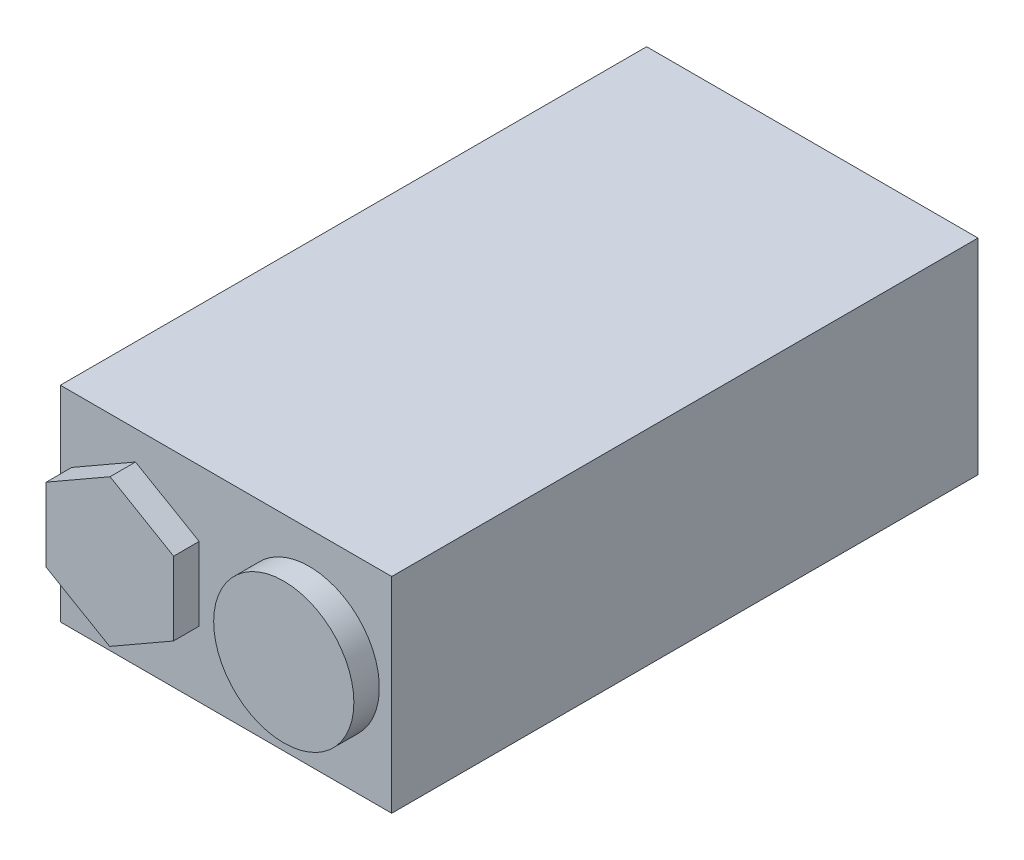
ISO-10303-21;
HEADER;
FILE_DESCRIPTION(('STEP AP214'),'2;1');
FILE_NAME('part.step','',(''),(''),'','','');
FILE_SCHEMA(('AUTOMOTIVE_DESIGN { 1 0 10303 214 1 1 1 1 }'));
ENDSEC;
DATA;
#1=APPLICATION_CONTEXT('core data for automotive mechanical design processes');
#2=APPLICATION_PROTOCOL_DEFINITION('international standard','automotive_design',2000,#1);
#3=PRODUCT_CONTEXT('',#1,'mechanical');
#4=PRODUCT('Part','Part','',(#3));
#5=PRODUCT_RELATED_PRODUCT_CATEGORY('part','',(#4));
#6=PRODUCT_DEFINITION_FORMATION('','',#4);
#7=PRODUCT_DEFINITION_CONTEXT('part definition',#1,'design');
#8=PRODUCT_DEFINITION('design','',#6,#7);
#9=PRODUCT_DEFINITION_SHAPE('','',#8);
#10=(LENGTH_UNIT() NAMED_UNIT(*) SI_UNIT(.MILLI.,.METRE.));
#11=(NAMED_UNIT(*) PLANE_ANGLE_UNIT() SI_UNIT($,.RADIAN.));
#12=(NAMED_UNIT(*) SI_UNIT($,.STERADIAN.) SOLID_ANGLE_UNIT());
#13=UNCERTAINTY_MEASURE_WITH_UNIT(LENGTH_MEASURE(1.E-05),#10,'distance_accuracy_value','');
#14=(GEOMETRIC_REPRESENTATION_CONTEXT(3) GLOBAL_UNCERTAINTY_ASSIGNED_CONTEXT((#13)) GLOBAL_UNIT_ASSIGNED_CONTEXT((#10,
#11,#12)) REPRESENTATION_CONTEXT('',''));
#15=CARTESIAN_POINT('',(0.,0.,0.));
#16=DIRECTION('',(0.,0.,1.));
#17=DIRECTION('',(1.,0.,0.));
#18=AXIS2_PLACEMENT_3D('',#15,#16,#17);
#19=CARTESIAN_POINT('',(0.,0.,46.));
#20=DIRECTION('',(0.,0.,-1.));
#21=DIRECTION('',(-1.,0.,0.));
#22=AXIS2_PLACEMENT_3D('',#19,#20,#21);
#23=PLANE('',#22);
#24=CARTESIAN_POINT('',(6.52944447302219,0.,46.));
#25=DIRECTION('',(0.,0.,-1.));
#26=DIRECTION('',(-1.,0.,0.));
#27=AXIS2_PLACEMENT_3D('',#24,#25,#26);
#28=CIRCLE('',#27,5.5);
#29=CARTESIAN_POINT('',(1.02944447302219,0.,46.));
#30=VERTEX_POINT('',#29);
#31=EDGE_CURVE('E11',#30,#30,#28,.F.);
#32=ORIENTED_EDGE('',*,*,#31,.F.);
#33=EDGE_LOOP('',(#32));
#34=FACE_BOUND('',#33,.T.);
#35=DIRECTION('',(0.,-1.,0.));
#36=VECTOR('',#35,1.);
#37=CARTESIAN_POINT('',(-13.,8.045,46.));
#38=LINE('',#37,#36);
#39=CARTESIAN_POINT('',(-13.,8.045,46.));
#40=VERTEX_POINT('',#39);
#41=CARTESIAN_POINT('',(-13.,-8.045,46.));
#42=VERTEX_POINT('',#41);
#43=EDGE_CURVE('E152',#40,#42,#38,.T.);
#44=ORIENTED_EDGE('',*,*,#43,.T.);
#45=DIRECTION('',(1.,0.,0.));
#46=VECTOR('',#45,1.);
#47=CARTESIAN_POINT('',(13.,-8.045,46.));
#48=LINE('',#47,#46);
#49=CARTESIAN_POINT('',(13.,-8.045,46.));
#50=VERTEX_POINT('',#49);
#51=EDGE_CURVE('E156',#42,#50,#48,.T.);
#52=ORIENTED_EDGE('',*,*,#51,.T.);
#53=DIRECTION('',(0.,1.,0.));
#54=VECTOR('',#53,1.);
#55=CARTESIAN_POINT('',(13.,8.045,46.));
#56=LINE('',#55,#54);
#57=CARTESIAN_POINT('',(13.,8.045,46.));
#58=VERTEX_POINT('',#57);
#59=EDGE_CURVE('E160',#50,#58,#56,.T.);
#60=ORIENTED_EDGE('',*,*,#59,.T.);
#61=DIRECTION('',(-1.,0.,0.));
#62=VECTOR('',#61,1.);
#63=CARTESIAN_POINT('',(13.,8.045,46.));
#64=LINE('',#63,#62);
#65=EDGE_CURVE('E163',#58,#40,#64,.T.);
#66=ORIENTED_EDGE('',*,*,#65,.T.);
#67=EDGE_LOOP('',(#44,#52,#60,#66));
#68=FACE_BOUND('',#67,.T.);
#69=DIRECTION('',(0.864665708593181,-0.502347700684548,0.));
#70=VECTOR('',#69,1.);
#71=CARTESIAN_POINT('',(-12.1269079719905,-2.87317564188084,46.));
#72=LINE('',#71,#70);
#73=CARTESIAN_POINT('',(-12.1269079719905,-2.87317564188084,46.));
#74=VERTEX_POINT('',#73);
#75=CARTESIAN_POINT('',(-7.13475817583735,-5.77348144405097,46.));
#76=VERTEX_POINT('',#75);
#77=EDGE_CURVE('E139',#74,#76,#72,.T.);
#78=ORIENTED_EDGE('',*,*,#77,.F.);
#79=DIRECTION('',(-0.00271301602892977,-0.999996319765241,0.));
#80=VECTOR('',#79,1.);
#81=CARTESIAN_POINT('',(-12.1112443666443,2.90030580217014,46.));
#82=LINE('',#81,#80);
#83=CARTESIAN_POINT('',(-12.1112443666443,2.90030580217014,46.));
#84=VERTEX_POINT('',#83);
#85=EDGE_CURVE('E136',#84,#74,#82,.T.);
#86=ORIENTED_EDGE('',*,*,#85,.F.);
#87=DIRECTION('',(-0.867378724622111,-0.497648619080693,0.));
#88=VECTOR('',#87,1.);
#89=CARTESIAN_POINT('',(-7.10343096514498,5.77348144405097,46.));
#90=LINE('',#89,#88);
#91=CARTESIAN_POINT('',(-7.10343096514498,5.77348144405097,46.));
#92=VERTEX_POINT('',#91);
#93=EDGE_CURVE('E221',#92,#84,#90,.T.);
#94=ORIENTED_EDGE('',*,*,#93,.F.);
#95=DIRECTION('',(-0.864665708593181,0.502347700684548,0.));
#96=VECTOR('',#95,1.);
#97=CARTESIAN_POINT('',(-2.11128116899187,2.87317564188084,46.));
#98=LINE('',#97,#96);
#99=CARTESIAN_POINT('',(-2.11128116899187,2.87317564188084,46.));
#100=VERTEX_POINT('',#99);
#101=EDGE_CURVE('E243',#100,#92,#98,.T.);
#102=ORIENTED_EDGE('',*,*,#101,.F.);
#103=DIRECTION('',(0.0027130160289297,0.999996319765241,0.));
#104=VECTOR('',#103,1.);
#105=CARTESIAN_POINT('',(-2.12694477433805,-2.90030580217014,46.));
#106=LINE('',#105,#104);
#107=CARTESIAN_POINT('',(-2.12694477433805,-2.90030580217014,46.));
#108=VERTEX_POINT('',#107);
#109=EDGE_CURVE('E60',#108,#100,#106,.T.);
#110=ORIENTED_EDGE('',*,*,#109,.F.);
#111=DIRECTION('',(0.867378724622111,0.497648619080693,0.));
#112=VECTOR('',#111,1.);
#113=CARTESIAN_POINT('',(-7.13475817583735,-5.77348144405097,46.));
#114=LINE('',#113,#112);
#115=EDGE_CURVE('E55',#76,#108,#114,.T.);
#116=ORIENTED_EDGE('',*,*,#115,.F.);
#117=EDGE_LOOP('',(#78,#86,#94,#102,#110,#116));
#118=FACE_BOUND('',#117,.T.);
#119=ADVANCED_FACE('F39',(#34,#68,#118),#23,.F.);
#120=CARTESIAN_POINT('',(-13.,8.045,46.));
#121=DIRECTION('',(1.,0.,0.));
#122=DIRECTION('',(0.,1.,0.));
#123=AXIS2_PLACEMENT_3D('',#120,#121,#122);
#124=PLANE('',#123);
#125=DIRECTION('',(0.,-1.,0.));
#126=VECTOR('',#125,1.);
#127=CARTESIAN_POINT('',(-13.,8.045,0.));
#128=LINE('',#127,#126);
#129=CARTESIAN_POINT('',(-13.,8.045,0.));
#130=VERTEX_POINT('',#129);
#131=CARTESIAN_POINT('',(-13.,-8.045,0.));
#132=VERTEX_POINT('',#131);
#133=EDGE_CURVE('E141',#130,#132,#128,.T.);
#134=ORIENTED_EDGE('',*,*,#133,.T.);
#135=DIRECTION('',(0.,0.,-1.));
#136=VECTOR('',#135,1.);
#137=CARTESIAN_POINT('',(-13.,-8.045,46.));
#138=LINE('',#137,#136);
#139=EDGE_CURVE('E48',#42,#132,#138,.T.);
#140=ORIENTED_EDGE('',*,*,#139,.F.);
#141=ORIENTED_EDGE('',*,*,#43,.F.);
#142=DIRECTION('',(0.,0.,-1.));
#143=VECTOR('',#142,1.);
#144=CARTESIAN_POINT('',(-13.,8.045,46.));
#145=LINE('',#144,#143);
#146=EDGE_CURVE('E165',#40,#130,#145,.T.);
#147=ORIENTED_EDGE('',*,*,#146,.T.);
#148=EDGE_LOOP('',(#134,#140,#141,#147));
#149=FACE_BOUND('',#148,.T.);
#150=ADVANCED_FACE('F41',(#149),#124,.F.);
#151=CARTESIAN_POINT('',(13.,-8.045,46.));
#152=DIRECTION('',(0.,1.,0.));
#153=DIRECTION('',(-1.,0.,0.));
#154=AXIS2_PLACEMENT_3D('',#151,#152,#153);
#155=PLANE('',#154);
#156=DIRECTION('',(1.,0.,0.));
#157=VECTOR('',#156,1.);
#158=CARTESIAN_POINT('',(13.,-8.045,0.));
#159=LINE('',#158,#157);
#160=CARTESIAN_POINT('',(13.,-8.045,0.));
#161=VERTEX_POINT('',#160);
#162=EDGE_CURVE('E146',#132,#161,#159,.T.);
#163=ORIENTED_EDGE('',*,*,#162,.T.);
#164=DIRECTION('',(0.,0.,-1.));
#165=VECTOR('',#164,1.);
#166=CARTESIAN_POINT('',(13.,-8.045,46.));
#167=LINE('',#166,#165);
#168=EDGE_CURVE('E181',#50,#161,#167,.T.);
#169=ORIENTED_EDGE('',*,*,#168,.F.);
#170=ORIENTED_EDGE('',*,*,#51,.F.);
#171=ORIENTED_EDGE('',*,*,#139,.T.);
#172=EDGE_LOOP('',(#163,#169,#170,#171));
#173=FACE_BOUND('',#172,.T.);
#174=ADVANCED_FACE('F188',(#173),#155,.F.);
#175=CARTESIAN_POINT('',(13.,8.045,46.));
#176=DIRECTION('',(-1.,0.,0.));
#177=DIRECTION('',(0.,-1.,0.));
#178=AXIS2_PLACEMENT_3D('',#175,#176,#177);
#179=PLANE('',#178);
#180=DIRECTION('',(0.,1.,0.));
#181=VECTOR('',#180,1.);
#182=CARTESIAN_POINT('',(13.,8.045,0.));
#183=LINE('',#182,#181);
#184=CARTESIAN_POINT('',(13.,8.045,0.));
#185=VERTEX_POINT('',#184);
#186=EDGE_CURVE('E169',#161,#185,#183,.T.);
#187=ORIENTED_EDGE('',*,*,#186,.T.);
#188=DIRECTION('',(0.,0.,-1.));
#189=VECTOR('',#188,1.);
#190=CARTESIAN_POINT('',(13.,8.045,46.));
#191=LINE('',#190,#189);
#192=EDGE_CURVE('E177',#58,#185,#191,.T.);
#193=ORIENTED_EDGE('',*,*,#192,.F.);
#194=ORIENTED_EDGE('',*,*,#59,.F.);
#195=ORIENTED_EDGE('',*,*,#168,.T.);
#196=EDGE_LOOP('',(#187,#193,#194,#195));
#197=FACE_BOUND('',#196,.T.);
#198=ADVANCED_FACE('F200',(#197),#179,.F.);
#199=CARTESIAN_POINT('',(13.,8.045,46.));
#200=DIRECTION('',(0.,-1.,0.));
#201=DIRECTION('',(1.,0.,0.));
#202=AXIS2_PLACEMENT_3D('',#199,#200,#201);
#203=PLANE('',#202);
#204=DIRECTION('',(-1.,0.,0.));
#205=VECTOR('',#204,1.);
#206=CARTESIAN_POINT('',(13.,8.045,0.));
#207=LINE('',#206,#205);
#208=EDGE_CURVE('E157',#185,#130,#207,.T.);
#209=ORIENTED_EDGE('',*,*,#208,.T.);
#210=ORIENTED_EDGE('',*,*,#146,.F.);
#211=ORIENTED_EDGE('',*,*,#65,.F.);
#212=ORIENTED_EDGE('',*,*,#192,.T.);
#213=EDGE_LOOP('',(#209,#210,#211,#212));
#214=FACE_BOUND('',#213,.T.);
#215=ADVANCED_FACE('F204',(#214),#203,.F.);
#216=CARTESIAN_POINT('',(0.,0.,0.));
#217=DIRECTION('',(0.,0.,-1.));
#218=DIRECTION('',(-1.,0.,0.));
#219=AXIS2_PLACEMENT_3D('',#216,#217,#218);
#220=PLANE('',#219);
#221=ORIENTED_EDGE('',*,*,#133,.F.);
#222=ORIENTED_EDGE('',*,*,#208,.F.);
#223=ORIENTED_EDGE('',*,*,#186,.F.);
#224=ORIENTED_EDGE('',*,*,#162,.F.);
#225=EDGE_LOOP('',(#221,#222,#223,#224));
#226=FACE_BOUND('',#225,.T.);
#227=ADVANCED_FACE('F196',(#226),#220,.T.);
#228=CARTESIAN_POINT('',(-12.1269079719905,-2.87317564188084,48.));
#229=DIRECTION('',(0.502347700684548,0.864665708593181,0.));
#230=DIRECTION('',(-0.864665708593181,0.502347700684548,0.));
#231=AXIS2_PLACEMENT_3D('',#228,#229,#230);
#232=PLANE('',#231);
#233=ORIENTED_EDGE('',*,*,#77,.T.);
#234=DIRECTION('',(0.,0.,-1.));
#235=VECTOR('',#234,1.);
#236=CARTESIAN_POINT('',(-7.13475817583735,-5.77348144405097,48.));
#237=LINE('',#236,#235);
#238=CARTESIAN_POINT('',(-7.13475817583735,-5.77348144405097,48.));
#239=VERTEX_POINT('',#238);
#240=EDGE_CURVE('E118',#239,#76,#237,.T.);
#241=ORIENTED_EDGE('',*,*,#240,.F.);
#242=DIRECTION('',(0.864665708593181,-0.502347700684548,0.));
#243=VECTOR('',#242,1.);
#244=CARTESIAN_POINT('',(-12.1269079719905,-2.87317564188084,48.));
#245=LINE('',#244,#243);
#246=CARTESIAN_POINT('',(-12.1269079719905,-2.87317564188084,48.));
#247=VERTEX_POINT('',#246);
#248=EDGE_CURVE('E126',#247,#239,#245,.T.);
#249=ORIENTED_EDGE('',*,*,#248,.F.);
#250=DIRECTION('',(0.,0.,-1.));
#251=VECTOR('',#250,1.);
#252=CARTESIAN_POINT('',(-12.1269079719905,-2.87317564188084,48.));
#253=LINE('',#252,#251);
#254=EDGE_CURVE('E217',#247,#74,#253,.T.);
#255=ORIENTED_EDGE('',*,*,#254,.T.);
#256=EDGE_LOOP('',(#233,#241,#249,#255));
#257=FACE_BOUND('',#256,.T.);
#258=ADVANCED_FACE('F138',(#257),#232,.F.);
#259=CARTESIAN_POINT('',(-7.13475817583735,-5.77348144405097,48.));
#260=DIRECTION('',(-0.497648619080693,0.867378724622111,0.));
#261=DIRECTION('',(-0.867378724622111,-0.497648619080693,0.));
#262=AXIS2_PLACEMENT_3D('',#259,#260,#261);
#263=PLANE('',#262);
#264=ORIENTED_EDGE('',*,*,#115,.T.);
#265=DIRECTION('',(0.,0.,-1.));
#266=VECTOR('',#265,1.);
#267=CARTESIAN_POINT('',(-2.12694477433805,-2.90030580217014,48.));
#268=LINE('',#267,#266);
#269=CARTESIAN_POINT('',(-2.12694477433805,-2.90030580217014,48.));
#270=VERTEX_POINT('',#269);
#271=EDGE_CURVE('E121',#270,#108,#268,.T.);
#272=ORIENTED_EDGE('',*,*,#271,.F.);
#273=DIRECTION('',(0.867378724622111,0.497648619080693,0.));
#274=VECTOR('',#273,1.);
#275=CARTESIAN_POINT('',(-7.13475817583735,-5.77348144405097,48.));
#276=LINE('',#275,#274);
#277=EDGE_CURVE('E114',#239,#270,#276,.T.);
#278=ORIENTED_EDGE('',*,*,#277,.F.);
#279=ORIENTED_EDGE('',*,*,#240,.T.);
#280=EDGE_LOOP('',(#264,#272,#278,#279));
#281=FACE_BOUND('',#280,.T.);
#282=ADVANCED_FACE('F116',(#281),#263,.F.);
#283=CARTESIAN_POINT('',(-2.12694477433805,-2.90030580217014,48.));
#284=DIRECTION('',(-0.999996319765241,0.0027130160289297,0.));
#285=DIRECTION('',(-0.0027130160289297,-0.999996319765241,0.));
#286=AXIS2_PLACEMENT_3D('',#283,#284,#285);
#287=PLANE('',#286);
#288=ORIENTED_EDGE('',*,*,#109,.T.);
#289=DIRECTION('',(0.,0.,-1.));
#290=VECTOR('',#289,1.);
#291=CARTESIAN_POINT('',(-2.11128116899187,2.87317564188084,48.));
#292=LINE('',#291,#290);
#293=CARTESIAN_POINT('',(-2.11128116899187,2.87317564188084,48.));
#294=VERTEX_POINT('',#293);
#295=EDGE_CURVE('E148',#294,#100,#292,.T.);
#296=ORIENTED_EDGE('',*,*,#295,.F.);
#297=DIRECTION('',(0.0027130160289297,0.999996319765241,0.));
#298=VECTOR('',#297,1.);
#299=CARTESIAN_POINT('',(-2.12694477433805,-2.90030580217014,48.));
#300=LINE('',#299,#298);
#301=EDGE_CURVE('E125',#270,#294,#300,.T.);
#302=ORIENTED_EDGE('',*,*,#301,.F.);
#303=ORIENTED_EDGE('',*,*,#271,.T.);
#304=EDGE_LOOP('',(#288,#296,#302,#303));
#305=FACE_BOUND('',#304,.T.);
#306=ADVANCED_FACE('F246',(#305),#287,.F.);
#307=CARTESIAN_POINT('',(-2.11128116899187,2.87317564188084,48.));
#308=DIRECTION('',(-0.502347700684548,-0.864665708593181,0.));
#309=DIRECTION('',(0.864665708593181,-0.502347700684548,0.));
#310=AXIS2_PLACEMENT_3D('',#307,#308,#309);
#311=PLANE('',#310);
#312=ORIENTED_EDGE('',*,*,#101,.T.);
#313=DIRECTION('',(0.,0.,-1.));
#314=VECTOR('',#313,1.);
#315=CARTESIAN_POINT('',(-7.10343096514498,5.77348144405097,48.));
#316=LINE('',#315,#314);
#317=CARTESIAN_POINT('',(-7.10343096514498,5.77348144405097,48.));
#318=VERTEX_POINT('',#317);
#319=EDGE_CURVE('E227',#318,#92,#316,.T.);
#320=ORIENTED_EDGE('',*,*,#319,.F.);
#321=DIRECTION('',(-0.864665708593181,0.502347700684548,0.));
#322=VECTOR('',#321,1.);
#323=CARTESIAN_POINT('',(-2.11128116899187,2.87317564188084,48.));
#324=LINE('',#323,#322);
#325=EDGE_CURVE('E244',#294,#318,#324,.T.);
#326=ORIENTED_EDGE('',*,*,#325,.F.);
#327=ORIENTED_EDGE('',*,*,#295,.T.);
#328=EDGE_LOOP('',(#312,#320,#326,#327));
#329=FACE_BOUND('',#328,.T.);
#330=ADVANCED_FACE('F241',(#329),#311,.F.);
#331=CARTESIAN_POINT('',(-7.10343096514498,5.77348144405097,48.));
#332=DIRECTION('',(0.497648619080693,-0.867378724622111,0.));
#333=DIRECTION('',(0.867378724622111,0.497648619080693,0.));
#334=AXIS2_PLACEMENT_3D('',#331,#332,#333);
#335=PLANE('',#334);
#336=ORIENTED_EDGE('',*,*,#93,.T.);
#337=DIRECTION('',(0.,0.,-1.));
#338=VECTOR('',#337,1.);
#339=CARTESIAN_POINT('',(-12.1112443666443,2.90030580217014,48.));
#340=LINE('',#339,#338);
#341=CARTESIAN_POINT('',(-12.1112443666443,2.90030580217014,48.));
#342=VERTEX_POINT('',#341);
#343=EDGE_CURVE('E219',#342,#84,#340,.T.);
#344=ORIENTED_EDGE('',*,*,#343,.F.);
#345=DIRECTION('',(-0.867378724622111,-0.497648619080693,0.));
#346=VECTOR('',#345,1.);
#347=CARTESIAN_POINT('',(-7.10343096514498,5.77348144405097,48.));
#348=LINE('',#347,#346);
#349=EDGE_CURVE('E229',#318,#342,#348,.T.);
#350=ORIENTED_EDGE('',*,*,#349,.F.);
#351=ORIENTED_EDGE('',*,*,#319,.T.);
#352=EDGE_LOOP('',(#336,#344,#350,#351));
#353=FACE_BOUND('',#352,.T.);
#354=ADVANCED_FACE('F255',(#353),#335,.F.);
#355=CARTESIAN_POINT('',(-12.1112443666443,2.90030580217014,48.));
#356=DIRECTION('',(0.999996319765241,-0.00271301602892977,0.));
#357=DIRECTION('',(0.00271301602892977,0.999996319765241,0.));
#358=AXIS2_PLACEMENT_3D('',#355,#356,#357);
#359=PLANE('',#358);
#360=ORIENTED_EDGE('',*,*,#85,.T.);
#361=ORIENTED_EDGE('',*,*,#254,.F.);
#362=DIRECTION('',(-0.00271301602892977,-0.999996319765241,0.));
#363=VECTOR('',#362,1.);
#364=CARTESIAN_POINT('',(-12.1112443666443,2.90030580217014,48.));
#365=LINE('',#364,#363);
#366=EDGE_CURVE('E131',#342,#247,#365,.T.);
#367=ORIENTED_EDGE('',*,*,#366,.F.);
#368=ORIENTED_EDGE('',*,*,#343,.T.);
#369=EDGE_LOOP('',(#360,#361,#367,#368));
#370=FACE_BOUND('',#369,.T.);
#371=ADVANCED_FACE('F216',(#370),#359,.F.);
#372=CARTESIAN_POINT('',(0.,0.,48.));
#373=DIRECTION('',(0.,0.,1.));
#374=DIRECTION('',(1.,0.,0.));
#375=AXIS2_PLACEMENT_3D('',#372,#373,#374);
#376=PLANE('',#375);
#377=ORIENTED_EDGE('',*,*,#248,.T.);
#378=ORIENTED_EDGE('',*,*,#277,.T.);
#379=ORIENTED_EDGE('',*,*,#301,.T.);
#380=ORIENTED_EDGE('',*,*,#325,.T.);
#381=ORIENTED_EDGE('',*,*,#349,.T.);
#382=ORIENTED_EDGE('',*,*,#366,.T.);
#383=EDGE_LOOP('',(#377,#378,#379,#380,#381,#382));
#384=FACE_BOUND('',#383,.T.);
#385=ADVANCED_FACE('F129',(#384),#376,.T.);
#386=CARTESIAN_POINT('',(6.52944447302219,0.,48.));
#387=DIRECTION('',(0.,0.,-1.));
#388=DIRECTION('',(-1.,0.,0.));
#389=AXIS2_PLACEMENT_3D('',#386,#387,#388);
#390=CYLINDRICAL_SURFACE('',#389,5.5);
#391=CARTESIAN_POINT('',(6.52944447302219,0.,48.));
#392=DIRECTION('',(0.,0.,1.));
#393=DIRECTION('',(1.,0.,0.));
#394=AXIS2_PLACEMENT_3D('',#391,#392,#393);
#395=CIRCLE('',#394,5.5);
#396=CARTESIAN_POINT('',(12.0294444730222,0.,48.));
#397=VERTEX_POINT('',#396);
#398=EDGE_CURVE('E212',#397,#397,#395,.T.);
#399=ORIENTED_EDGE('',*,*,#398,.F.);
#400=EDGE_LOOP('',(#399));
#401=FACE_BOUND('',#400,.T.);
#402=ORIENTED_EDGE('',*,*,#31,.T.);
#403=EDGE_LOOP('',(#402));
#404=FACE_BOUND('',#403,.T.);
#405=ADVANCED_FACE('F270',(#401,#404),#390,.T.);
#406=CARTESIAN_POINT('',(6.52944447302219,0.,48.));
#407=DIRECTION('',(0.,0.,1.));
#408=DIRECTION('',(1.,0.,0.));
#409=AXIS2_PLACEMENT_3D('',#406,#407,#408);
#410=PLANE('',#409);
#411=ORIENTED_EDGE('',*,*,#398,.T.);
#412=EDGE_LOOP('',(#411));
#413=FACE_BOUND('',#412,.T.);
#414=ADVANCED_FACE('F268',(#413),#410,.T.);
#415=CLOSED_SHELL('',(#119,#150,#174,#198,#215,#227,#258,#282,#306,#330,#354,#371,#385,#405,#414));
#416=MANIFOLD_SOLID_BREP('B2',#415);
#417=ADVANCED_BREP_SHAPE_REPRESENTATION('',(#18,#416),#14);
#418=SHAPE_DEFINITION_REPRESENTATION(#9,#417);
ENDSEC;
END-ISO-10303-21;
